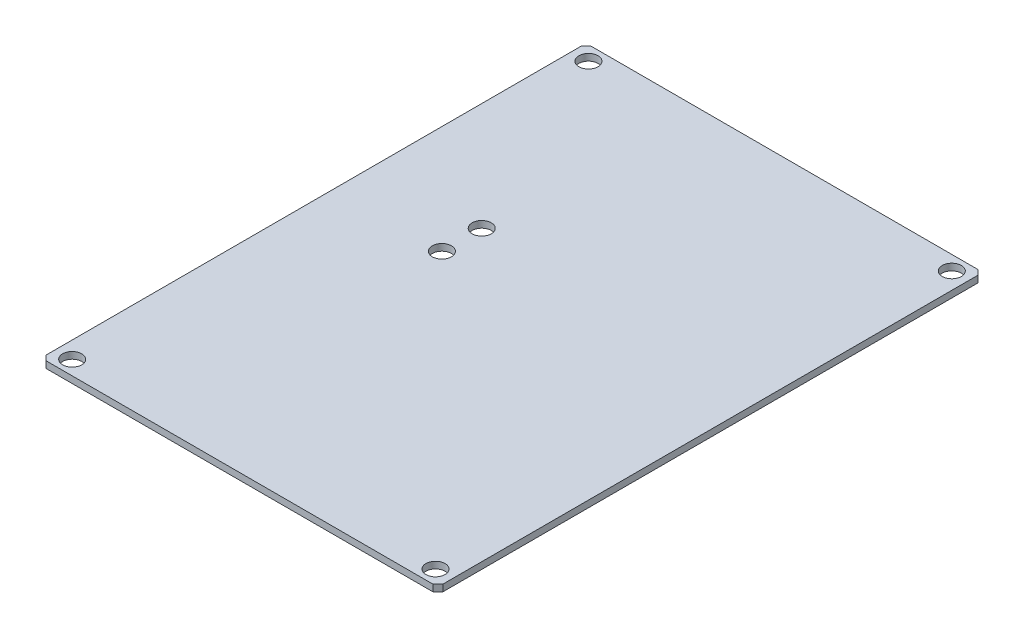
ISO-10303-21;
HEADER;
FILE_DESCRIPTION(('STEP AP214'),'2;1');
FILE_NAME('part.step','',(''),(''),'','','');
FILE_SCHEMA(('AUTOMOTIVE_DESIGN { 1 0 10303 214 1 1 1 1 }'));
ENDSEC;
DATA;
#1=APPLICATION_CONTEXT('core data for automotive mechanical design processes');
#2=APPLICATION_PROTOCOL_DEFINITION('international standard','automotive_design',2000,#1);
#3=PRODUCT_CONTEXT('',#1,'mechanical');
#4=PRODUCT('Part','Part','',(#3));
#5=PRODUCT_RELATED_PRODUCT_CATEGORY('part','',(#4));
#6=PRODUCT_DEFINITION_FORMATION('','',#4);
#7=PRODUCT_DEFINITION_CONTEXT('part definition',#1,'design');
#8=PRODUCT_DEFINITION('design','',#6,#7);
#9=PRODUCT_DEFINITION_SHAPE('','',#8);
#10=(LENGTH_UNIT() NAMED_UNIT(*) SI_UNIT(.MILLI.,.METRE.));
#11=(NAMED_UNIT(*) PLANE_ANGLE_UNIT() SI_UNIT($,.RADIAN.));
#12=(NAMED_UNIT(*) SI_UNIT($,.STERADIAN.) SOLID_ANGLE_UNIT());
#13=UNCERTAINTY_MEASURE_WITH_UNIT(LENGTH_MEASURE(1.E-05),#10,'distance_accuracy_value','');
#14=(GEOMETRIC_REPRESENTATION_CONTEXT(3) GLOBAL_UNCERTAINTY_ASSIGNED_CONTEXT((#13)) GLOBAL_UNIT_ASSIGNED_CONTEXT((#10,
#11,#12)) REPRESENTATION_CONTEXT('',''));
#15=CARTESIAN_POINT('',(0.,0.,0.));
#16=DIRECTION('',(0.,0.,1.));
#17=DIRECTION('',(1.,0.,0.));
#18=AXIS2_PLACEMENT_3D('',#15,#16,#17);
#19=CARTESIAN_POINT('',(20.75,0.7,0.));
#20=DIRECTION('',(1.,0.,0.));
#21=DIRECTION('',(0.,0.,-1.));
#22=AXIS2_PLACEMENT_3D('',#19,#20,#21);
#23=PLANE('',#22);
#24=DIRECTION('',(0.,0.,1.));
#25=VECTOR('',#24,1.);
#26=CARTESIAN_POINT('',(20.75,0.,0.));
#27=LINE('',#26,#25);
#28=CARTESIAN_POINT('',(20.75,0.,-27.9901394034831));
#29=VERTEX_POINT('',#28);
#30=CARTESIAN_POINT('',(20.75,0.,27.9901394034831));
#31=VERTEX_POINT('',#30);
#32=EDGE_CURVE('E131',#29,#31,#27,.T.);
#33=ORIENTED_EDGE('',*,*,#32,.F.);
#34=DIRECTION('',(0.,-1.,0.));
#35=VECTOR('',#34,1.);
#36=CARTESIAN_POINT('',(20.75,0.7,-27.9901394034831));
#37=LINE('',#36,#35);
#38=CARTESIAN_POINT('',(20.75,0.7,-27.9901394034831));
#39=VERTEX_POINT('',#38);
#40=EDGE_CURVE('E11',#39,#29,#37,.T.);
#41=ORIENTED_EDGE('',*,*,#40,.F.);
#42=DIRECTION('',(0.,0.,1.));
#43=VECTOR('',#42,1.);
#44=CARTESIAN_POINT('',(20.75,0.7,0.));
#45=LINE('',#44,#43);
#46=CARTESIAN_POINT('',(20.75,0.7,27.9901394034831));
#47=VERTEX_POINT('',#46);
#48=EDGE_CURVE('E152',#39,#47,#45,.T.);
#49=ORIENTED_EDGE('',*,*,#48,.T.);
#50=DIRECTION('',(0.,-1.,0.));
#51=VECTOR('',#50,1.);
#52=CARTESIAN_POINT('',(20.75,0.7,27.9901394034831));
#53=LINE('',#52,#51);
#54=EDGE_CURVE('E53',#47,#31,#53,.T.);
#55=ORIENTED_EDGE('',*,*,#54,.T.);
#56=EDGE_LOOP('',(#33,#41,#49,#55));
#57=FACE_BOUND('',#56,.T.);
#58=ADVANCED_FACE('F35',(#57),#23,.T.);
#59=CARTESIAN_POINT('',(24.3700697017416,0.7,-24.3700697017415));
#60=DIRECTION('',(-0.707106781186549,0.,0.707106781186546));
#61=DIRECTION('',(0.707106781186546,0.,0.707106781186549));
#62=AXIS2_PLACEMENT_3D('',#59,#60,#61);
#63=PLANE('',#62);
#64=DIRECTION('',(-0.707106781186546,0.,-0.707106781186549));
#65=VECTOR('',#64,1.);
#66=CARTESIAN_POINT('',(24.3700697017416,0.,-24.3700697017415));
#67=LINE('',#66,#65);
#68=CARTESIAN_POINT('',(20.2401394034831,0.,-28.5));
#69=VERTEX_POINT('',#68);
#70=EDGE_CURVE('E133',#29,#69,#67,.T.);
#71=ORIENTED_EDGE('',*,*,#70,.T.);
#72=DIRECTION('',(0.,-1.,0.));
#73=VECTOR('',#72,1.);
#74=CARTESIAN_POINT('',(20.2401394034831,0.7,-28.5));
#75=LINE('',#74,#73);
#76=CARTESIAN_POINT('',(20.2401394034831,0.7,-28.5));
#77=VERTEX_POINT('',#76);
#78=EDGE_CURVE('E44',#77,#69,#75,.T.);
#79=ORIENTED_EDGE('',*,*,#78,.F.);
#80=DIRECTION('',(-0.707106781186546,0.,-0.707106781186549));
#81=VECTOR('',#80,1.);
#82=CARTESIAN_POINT('',(24.3700697017416,0.7,-24.3700697017415));
#83=LINE('',#82,#81);
#84=EDGE_CURVE('E198',#39,#77,#83,.T.);
#85=ORIENTED_EDGE('',*,*,#84,.F.);
#86=ORIENTED_EDGE('',*,*,#40,.T.);
#87=EDGE_LOOP('',(#71,#79,#85,#86));
#88=FACE_BOUND('',#87,.T.);
#89=ADVANCED_FACE('F225',(#88),#63,.F.);
#90=CARTESIAN_POINT('',(0.,0.7,-28.5));
#91=DIRECTION('',(0.,0.,-1.));
#92=DIRECTION('',(-1.,0.,0.));
#93=AXIS2_PLACEMENT_3D('',#90,#91,#92);
#94=PLANE('',#93);
#95=DIRECTION('',(1.,0.,0.));
#96=VECTOR('',#95,1.);
#97=CARTESIAN_POINT('',(0.,0.,-28.5));
#98=LINE('',#97,#96);
#99=CARTESIAN_POINT('',(-20.2401394034831,0.,-28.5));
#100=VERTEX_POINT('',#99);
#101=EDGE_CURVE('E137',#100,#69,#98,.T.);
#102=ORIENTED_EDGE('',*,*,#101,.F.);
#103=DIRECTION('',(0.,-1.,0.));
#104=VECTOR('',#103,1.);
#105=CARTESIAN_POINT('',(-20.2401394034831,0.7,-28.5));
#106=LINE('',#105,#104);
#107=CARTESIAN_POINT('',(-20.2401394034831,0.7,-28.5));
#108=VERTEX_POINT('',#107);
#109=EDGE_CURVE('E158',#108,#100,#106,.T.);
#110=ORIENTED_EDGE('',*,*,#109,.F.);
#111=DIRECTION('',(1.,0.,0.));
#112=VECTOR('',#111,1.);
#113=CARTESIAN_POINT('',(0.,0.7,-28.5));
#114=LINE('',#113,#112);
#115=EDGE_CURVE('E200',#108,#77,#114,.T.);
#116=ORIENTED_EDGE('',*,*,#115,.T.);
#117=ORIENTED_EDGE('',*,*,#78,.T.);
#118=EDGE_LOOP('',(#102,#110,#116,#117));
#119=FACE_BOUND('',#118,.T.);
#120=ADVANCED_FACE('F229',(#119),#94,.T.);
#121=CARTESIAN_POINT('',(-24.3700697017416,0.7,-24.3700697017415));
#122=DIRECTION('',(-0.707106781186549,0.,-0.707106781186546));
#123=DIRECTION('',(-0.707106781186546,0.,0.707106781186549));
#124=AXIS2_PLACEMENT_3D('',#121,#122,#123);
#125=PLANE('',#124);
#126=DIRECTION('',(0.707106781186546,0.,-0.707106781186549));
#127=VECTOR('',#126,1.);
#128=CARTESIAN_POINT('',(-24.3700697017416,0.,-24.3700697017415));
#129=LINE('',#128,#127);
#130=CARTESIAN_POINT('',(-20.75,0.,-27.9901394034831));
#131=VERTEX_POINT('',#130);
#132=EDGE_CURVE('E140',#131,#100,#129,.T.);
#133=ORIENTED_EDGE('',*,*,#132,.F.);
#134=DIRECTION('',(0.,-1.,0.));
#135=VECTOR('',#134,1.);
#136=CARTESIAN_POINT('',(-20.75,0.7,-27.9901394034831));
#137=LINE('',#136,#135);
#138=CARTESIAN_POINT('',(-20.75,0.7,-27.9901394034831));
#139=VERTEX_POINT('',#138);
#140=EDGE_CURVE('E156',#139,#131,#137,.T.);
#141=ORIENTED_EDGE('',*,*,#140,.F.);
#142=DIRECTION('',(0.707106781186546,0.,-0.707106781186549));
#143=VECTOR('',#142,1.);
#144=CARTESIAN_POINT('',(-24.3700697017416,0.7,-24.3700697017415));
#145=LINE('',#144,#143);
#146=EDGE_CURVE('E203',#139,#108,#145,.T.);
#147=ORIENTED_EDGE('',*,*,#146,.T.);
#148=ORIENTED_EDGE('',*,*,#109,.T.);
#149=EDGE_LOOP('',(#133,#141,#147,#148));
#150=FACE_BOUND('',#149,.T.);
#151=ADVANCED_FACE('F234',(#150),#125,.T.);
#152=CARTESIAN_POINT('',(-20.75,0.7,0.));
#153=DIRECTION('',(-1.,0.,0.));
#154=DIRECTION('',(0.,0.,1.));
#155=AXIS2_PLACEMENT_3D('',#152,#153,#154);
#156=PLANE('',#155);
#157=DIRECTION('',(0.,0.,-1.));
#158=VECTOR('',#157,1.);
#159=CARTESIAN_POINT('',(-20.75,0.,0.));
#160=LINE('',#159,#158);
#161=CARTESIAN_POINT('',(-20.75,0.,27.9901394034831));
#162=VERTEX_POINT('',#161);
#163=EDGE_CURVE('E143',#162,#131,#160,.T.);
#164=ORIENTED_EDGE('',*,*,#163,.F.);
#165=DIRECTION('',(0.,-1.,0.));
#166=VECTOR('',#165,1.);
#167=CARTESIAN_POINT('',(-20.75,0.7,27.9901394034831));
#168=LINE('',#167,#166);
#169=CARTESIAN_POINT('',(-20.75,0.7,27.9901394034831));
#170=VERTEX_POINT('',#169);
#171=EDGE_CURVE('E123',#170,#162,#168,.T.);
#172=ORIENTED_EDGE('',*,*,#171,.F.);
#173=DIRECTION('',(0.,0.,-1.));
#174=VECTOR('',#173,1.);
#175=CARTESIAN_POINT('',(-20.75,0.7,0.));
#176=LINE('',#175,#174);
#177=EDGE_CURVE('E113',#170,#139,#176,.T.);
#178=ORIENTED_EDGE('',*,*,#177,.T.);
#179=ORIENTED_EDGE('',*,*,#140,.T.);
#180=EDGE_LOOP('',(#164,#172,#178,#179));
#181=FACE_BOUND('',#180,.T.);
#182=ADVANCED_FACE('F207',(#181),#156,.T.);
#183=CARTESIAN_POINT('',(-24.3700697017416,0.7,24.3700697017415));
#184=DIRECTION('',(0.707106781186549,0.,-0.707106781186546));
#185=DIRECTION('',(-0.707106781186546,0.,-0.707106781186549));
#186=AXIS2_PLACEMENT_3D('',#183,#184,#185);
#187=PLANE('',#186);
#188=DIRECTION('',(0.707106781186546,0.,0.707106781186549));
#189=VECTOR('',#188,1.);
#190=CARTESIAN_POINT('',(-24.3700697017416,0.,24.3700697017415));
#191=LINE('',#190,#189);
#192=CARTESIAN_POINT('',(-20.2401394034831,0.,28.5));
#193=VERTEX_POINT('',#192);
#194=EDGE_CURVE('E120',#162,#193,#191,.T.);
#195=ORIENTED_EDGE('',*,*,#194,.T.);
#196=DIRECTION('',(0.,-1.,0.));
#197=VECTOR('',#196,1.);
#198=CARTESIAN_POINT('',(-20.2401394034831,0.7,28.5));
#199=LINE('',#198,#197);
#200=CARTESIAN_POINT('',(-20.2401394034831,0.7,28.5));
#201=VERTEX_POINT('',#200);
#202=EDGE_CURVE('E117',#201,#193,#199,.T.);
#203=ORIENTED_EDGE('',*,*,#202,.F.);
#204=DIRECTION('',(0.707106781186546,0.,0.707106781186549));
#205=VECTOR('',#204,1.);
#206=CARTESIAN_POINT('',(-24.3700697017416,0.7,24.3700697017415));
#207=LINE('',#206,#205);
#208=EDGE_CURVE('E104',#170,#201,#207,.T.);
#209=ORIENTED_EDGE('',*,*,#208,.F.);
#210=ORIENTED_EDGE('',*,*,#171,.T.);
#211=EDGE_LOOP('',(#195,#203,#209,#210));
#212=FACE_BOUND('',#211,.T.);
#213=ADVANCED_FACE('F118',(#212),#187,.F.);
#214=CARTESIAN_POINT('',(0.,0.7,28.5));
#215=DIRECTION('',(0.,0.,-1.));
#216=DIRECTION('',(-1.,0.,0.));
#217=AXIS2_PLACEMENT_3D('',#214,#215,#216);
#218=PLANE('',#217);
#219=DIRECTION('',(1.,0.,0.));
#220=VECTOR('',#219,1.);
#221=CARTESIAN_POINT('',(0.,0.,28.5));
#222=LINE('',#221,#220);
#223=CARTESIAN_POINT('',(20.2401394034831,0.,28.5));
#224=VERTEX_POINT('',#223);
#225=EDGE_CURVE('E147',#193,#224,#222,.T.);
#226=ORIENTED_EDGE('',*,*,#225,.T.);
#227=DIRECTION('',(0.,-1.,0.));
#228=VECTOR('',#227,1.);
#229=CARTESIAN_POINT('',(20.2401394034831,0.7,28.5));
#230=LINE('',#229,#228);
#231=CARTESIAN_POINT('',(20.2401394034831,0.7,28.5));
#232=VERTEX_POINT('',#231);
#233=EDGE_CURVE('E79',#232,#224,#230,.T.);
#234=ORIENTED_EDGE('',*,*,#233,.F.);
#235=DIRECTION('',(1.,0.,0.));
#236=VECTOR('',#235,1.);
#237=CARTESIAN_POINT('',(0.,0.7,28.5));
#238=LINE('',#237,#236);
#239=EDGE_CURVE('E110',#201,#232,#238,.T.);
#240=ORIENTED_EDGE('',*,*,#239,.F.);
#241=ORIENTED_EDGE('',*,*,#202,.T.);
#242=EDGE_LOOP('',(#226,#234,#240,#241));
#243=FACE_BOUND('',#242,.T.);
#244=ADVANCED_FACE('F125',(#243),#218,.F.);
#245=CARTESIAN_POINT('',(24.3700697017416,0.7,24.3700697017415));
#246=DIRECTION('',(0.707106781186549,0.,0.707106781186546));
#247=DIRECTION('',(0.707106781186546,0.,-0.707106781186549));
#248=AXIS2_PLACEMENT_3D('',#245,#246,#247);
#249=PLANE('',#248);
#250=DIRECTION('',(-0.707106781186546,0.,0.707106781186549));
#251=VECTOR('',#250,1.);
#252=CARTESIAN_POINT('',(24.3700697017416,0.,24.3700697017415));
#253=LINE('',#252,#251);
#254=EDGE_CURVE('E149',#31,#224,#253,.T.);
#255=ORIENTED_EDGE('',*,*,#254,.F.);
#256=ORIENTED_EDGE('',*,*,#54,.F.);
#257=DIRECTION('',(-0.707106781186546,0.,0.707106781186549));
#258=VECTOR('',#257,1.);
#259=CARTESIAN_POINT('',(24.3700697017416,0.7,24.3700697017415));
#260=LINE('',#259,#258);
#261=EDGE_CURVE('E126',#47,#232,#260,.T.);
#262=ORIENTED_EDGE('',*,*,#261,.T.);
#263=ORIENTED_EDGE('',*,*,#233,.T.);
#264=EDGE_LOOP('',(#255,#256,#262,#263));
#265=FACE_BOUND('',#264,.T.);
#266=ADVANCED_FACE('F212',(#265),#249,.T.);
#267=CARTESIAN_POINT('',(0.,0.7,0.));
#268=DIRECTION('',(0.,1.,0.));
#269=DIRECTION('',(0.,0.,1.));
#270=AXIS2_PLACEMENT_3D('',#267,#268,#269);
#271=PLANE('',#270);
#272=CARTESIAN_POINT('',(-9.45,0.7,-6.28453018887489));
#273=DIRECTION('',(0.,1.,0.));
#274=DIRECTION('',(0.,0.,1.));
#275=AXIS2_PLACEMENT_3D('',#272,#273,#274);
#276=CIRCLE('',#275,1.);
#277=CARTESIAN_POINT('',(-9.45,0.7,-5.28453018887489));
#278=VERTEX_POINT('',#277);
#279=EDGE_CURVE('E174',#278,#278,#276,.T.);
#280=ORIENTED_EDGE('',*,*,#279,.F.);
#281=EDGE_LOOP('',(#280));
#282=FACE_BOUND('',#281,.T.);
#283=CARTESIAN_POINT('',(-9.45,0.7,-2.11546981112506));
#284=DIRECTION('',(0.,1.,0.));
#285=DIRECTION('',(0.,0.,1.));
#286=AXIS2_PLACEMENT_3D('',#283,#284,#285);
#287=CIRCLE('',#286,1.00000000000001);
#288=CARTESIAN_POINT('',(-9.45,0.7,-1.11546981112506));
#289=VERTEX_POINT('',#288);
#290=EDGE_CURVE('E180',#289,#289,#287,.T.);
#291=ORIENTED_EDGE('',*,*,#290,.F.);
#292=EDGE_LOOP('',(#291));
#293=FACE_BOUND('',#292,.T.);
#294=CARTESIAN_POINT('',(-19.,0.7,27.));
#295=DIRECTION('',(0.,1.,0.));
#296=DIRECTION('',(0.,0.,1.));
#297=AXIS2_PLACEMENT_3D('',#294,#295,#296);
#298=CIRCLE('',#297,1.);
#299=CARTESIAN_POINT('',(-19.,0.7,28.));
#300=VERTEX_POINT('',#299);
#301=EDGE_CURVE('E178',#300,#300,#298,.T.);
#302=ORIENTED_EDGE('',*,*,#301,.F.);
#303=EDGE_LOOP('',(#302));
#304=FACE_BOUND('',#303,.T.);
#305=CARTESIAN_POINT('',(19.,0.7,27.));
#306=DIRECTION('',(0.,1.,0.));
#307=DIRECTION('',(0.,0.,1.));
#308=AXIS2_PLACEMENT_3D('',#305,#306,#307);
#309=CIRCLE('',#308,1.);
#310=CARTESIAN_POINT('',(19.,0.7,28.));
#311=VERTEX_POINT('',#310);
#312=EDGE_CURVE('E190',#311,#311,#309,.T.);
#313=ORIENTED_EDGE('',*,*,#312,.F.);
#314=EDGE_LOOP('',(#313));
#315=FACE_BOUND('',#314,.T.);
#316=CARTESIAN_POINT('',(19.,0.7,-27.));
#317=DIRECTION('',(0.,1.,0.));
#318=DIRECTION('',(0.,0.,1.));
#319=AXIS2_PLACEMENT_3D('',#316,#317,#318);
#320=CIRCLE('',#319,1.);
#321=CARTESIAN_POINT('',(19.,0.7,-26.));
#322=VERTEX_POINT('',#321);
#323=EDGE_CURVE('E187',#322,#322,#320,.T.);
#324=ORIENTED_EDGE('',*,*,#323,.F.);
#325=EDGE_LOOP('',(#324));
#326=FACE_BOUND('',#325,.T.);
#327=CARTESIAN_POINT('',(-19.,0.7,-27.));
#328=DIRECTION('',(0.,1.,0.));
#329=DIRECTION('',(0.,0.,1.));
#330=AXIS2_PLACEMENT_3D('',#327,#328,#329);
#331=CIRCLE('',#330,0.999999999999998);
#332=CARTESIAN_POINT('',(-19.,0.7,-26.));
#333=VERTEX_POINT('',#332);
#334=EDGE_CURVE('E165',#333,#333,#331,.T.);
#335=ORIENTED_EDGE('',*,*,#334,.F.);
#336=EDGE_LOOP('',(#335));
#337=FACE_BOUND('',#336,.T.);
#338=ORIENTED_EDGE('',*,*,#48,.F.);
#339=ORIENTED_EDGE('',*,*,#84,.T.);
#340=ORIENTED_EDGE('',*,*,#115,.F.);
#341=ORIENTED_EDGE('',*,*,#146,.F.);
#342=ORIENTED_EDGE('',*,*,#177,.F.);
#343=ORIENTED_EDGE('',*,*,#208,.T.);
#344=ORIENTED_EDGE('',*,*,#239,.T.);
#345=ORIENTED_EDGE('',*,*,#261,.F.);
#346=EDGE_LOOP('',(#338,#339,#340,#341,#342,#343,#344,#345));
#347=FACE_BOUND('',#346,.T.);
#348=ADVANCED_FACE('F107',(#282,#293,#304,#315,#326,#337,#347),#271,.T.);
#349=CARTESIAN_POINT('',(0.,0.,0.));
#350=DIRECTION('',(0.,1.,0.));
#351=DIRECTION('',(0.,0.,1.));
#352=AXIS2_PLACEMENT_3D('',#349,#350,#351);
#353=PLANE('',#352);
#354=CARTESIAN_POINT('',(-9.45,0.,-6.28453018887489));
#355=DIRECTION('',(0.,1.,0.));
#356=DIRECTION('',(0.,0.,1.));
#357=AXIS2_PLACEMENT_3D('',#354,#355,#356);
#358=CIRCLE('',#357,1.);
#359=CARTESIAN_POINT('',(-9.45,0.,-5.28453018887489));
#360=VERTEX_POINT('',#359);
#361=EDGE_CURVE('E38',#360,#360,#358,.T.);
#362=ORIENTED_EDGE('',*,*,#361,.T.);
#363=EDGE_LOOP('',(#362));
#364=FACE_BOUND('',#363,.T.);
#365=CARTESIAN_POINT('',(-9.45,0.,-2.11546981112506));
#366=DIRECTION('',(0.,1.,0.));
#367=DIRECTION('',(0.,0.,1.));
#368=AXIS2_PLACEMENT_3D('',#365,#366,#367);
#369=CIRCLE('',#368,1.00000000000001);
#370=CARTESIAN_POINT('',(-9.45,0.,-1.11546981112506));
#371=VERTEX_POINT('',#370);
#372=EDGE_CURVE('E172',#371,#371,#369,.T.);
#373=ORIENTED_EDGE('',*,*,#372,.T.);
#374=EDGE_LOOP('',(#373));
#375=FACE_BOUND('',#374,.T.);
#376=CARTESIAN_POINT('',(-19.,0.,27.));
#377=DIRECTION('',(0.,1.,0.));
#378=DIRECTION('',(0.,0.,1.));
#379=AXIS2_PLACEMENT_3D('',#376,#377,#378);
#380=CIRCLE('',#379,1.);
#381=CARTESIAN_POINT('',(-19.,0.,28.));
#382=VERTEX_POINT('',#381);
#383=EDGE_CURVE('E134',#382,#382,#380,.T.);
#384=ORIENTED_EDGE('',*,*,#383,.T.);
#385=EDGE_LOOP('',(#384));
#386=FACE_BOUND('',#385,.T.);
#387=CARTESIAN_POINT('',(19.,0.,27.));
#388=DIRECTION('',(0.,1.,0.));
#389=DIRECTION('',(0.,0.,1.));
#390=AXIS2_PLACEMENT_3D('',#387,#388,#389);
#391=CIRCLE('',#390,1.);
#392=CARTESIAN_POINT('',(19.,0.,28.));
#393=VERTEX_POINT('',#392);
#394=EDGE_CURVE('E168',#393,#393,#391,.T.);
#395=ORIENTED_EDGE('',*,*,#394,.T.);
#396=EDGE_LOOP('',(#395));
#397=FACE_BOUND('',#396,.T.);
#398=CARTESIAN_POINT('',(19.,0.,-27.));
#399=DIRECTION('',(0.,1.,0.));
#400=DIRECTION('',(0.,0.,1.));
#401=AXIS2_PLACEMENT_3D('',#398,#399,#400);
#402=CIRCLE('',#401,1.);
#403=CARTESIAN_POINT('',(19.,0.,-26.));
#404=VERTEX_POINT('',#403);
#405=EDGE_CURVE('E164',#404,#404,#402,.T.);
#406=ORIENTED_EDGE('',*,*,#405,.T.);
#407=EDGE_LOOP('',(#406));
#408=FACE_BOUND('',#407,.T.);
#409=CARTESIAN_POINT('',(-19.,0.,-27.));
#410=DIRECTION('',(0.,1.,0.));
#411=DIRECTION('',(0.,0.,1.));
#412=AXIS2_PLACEMENT_3D('',#409,#410,#411);
#413=CIRCLE('',#412,0.999999999999998);
#414=CARTESIAN_POINT('',(-19.,0.,-26.));
#415=VERTEX_POINT('',#414);
#416=EDGE_CURVE('E161',#415,#415,#413,.T.);
#417=ORIENTED_EDGE('',*,*,#416,.T.);
#418=EDGE_LOOP('',(#417));
#419=FACE_BOUND('',#418,.T.);
#420=ORIENTED_EDGE('',*,*,#32,.T.);
#421=ORIENTED_EDGE('',*,*,#254,.T.);
#422=ORIENTED_EDGE('',*,*,#225,.F.);
#423=ORIENTED_EDGE('',*,*,#194,.F.);
#424=ORIENTED_EDGE('',*,*,#163,.T.);
#425=ORIENTED_EDGE('',*,*,#132,.T.);
#426=ORIENTED_EDGE('',*,*,#101,.T.);
#427=ORIENTED_EDGE('',*,*,#70,.F.);
#428=EDGE_LOOP('',(#420,#421,#422,#423,#424,#425,#426,#427));
#429=FACE_BOUND('',#428,.T.);
#430=ADVANCED_FACE('F210',(#364,#375,#386,#397,#408,#419,#429),#353,.F.);
#431=CARTESIAN_POINT('',(-19.,-4.3,-27.));
#432=DIRECTION('',(0.,1.,0.));
#433=DIRECTION('',(0.,0.,1.));
#434=AXIS2_PLACEMENT_3D('',#431,#432,#433);
#435=CYLINDRICAL_SURFACE('',#434,0.999999999999998);
#436=ORIENTED_EDGE('',*,*,#334,.T.);
#437=EDGE_LOOP('',(#436));
#438=FACE_BOUND('',#437,.T.);
#439=ORIENTED_EDGE('',*,*,#416,.F.);
#440=EDGE_LOOP('',(#439));
#441=FACE_BOUND('',#440,.T.);
#442=ADVANCED_FACE('F262',(#438,#441),#435,.F.);
#443=CARTESIAN_POINT('',(19.,-4.3,-27.));
#444=DIRECTION('',(0.,1.,0.));
#445=DIRECTION('',(0.,0.,1.));
#446=AXIS2_PLACEMENT_3D('',#443,#444,#445);
#447=CYLINDRICAL_SURFACE('',#446,1.);
#448=ORIENTED_EDGE('',*,*,#323,.T.);
#449=EDGE_LOOP('',(#448));
#450=FACE_BOUND('',#449,.T.);
#451=ORIENTED_EDGE('',*,*,#405,.F.);
#452=EDGE_LOOP('',(#451));
#453=FACE_BOUND('',#452,.T.);
#454=ADVANCED_FACE('F267',(#450,#453),#447,.F.);
#455=CARTESIAN_POINT('',(19.,-4.3,27.));
#456=DIRECTION('',(0.,1.,0.));
#457=DIRECTION('',(0.,0.,1.));
#458=AXIS2_PLACEMENT_3D('',#455,#456,#457);
#459=CYLINDRICAL_SURFACE('',#458,1.);
#460=ORIENTED_EDGE('',*,*,#312,.T.);
#461=EDGE_LOOP('',(#460));
#462=FACE_BOUND('',#461,.T.);
#463=ORIENTED_EDGE('',*,*,#394,.F.);
#464=EDGE_LOOP('',(#463));
#465=FACE_BOUND('',#464,.T.);
#466=ADVANCED_FACE('F279',(#462,#465),#459,.F.);
#467=CARTESIAN_POINT('',(-19.,-4.3,27.));
#468=DIRECTION('',(0.,1.,0.));
#469=DIRECTION('',(0.,0.,1.));
#470=AXIS2_PLACEMENT_3D('',#467,#468,#469);
#471=CYLINDRICAL_SURFACE('',#470,1.);
#472=ORIENTED_EDGE('',*,*,#301,.T.);
#473=EDGE_LOOP('',(#472));
#474=FACE_BOUND('',#473,.T.);
#475=ORIENTED_EDGE('',*,*,#383,.F.);
#476=EDGE_LOOP('',(#475));
#477=FACE_BOUND('',#476,.T.);
#478=ADVANCED_FACE('F289',(#474,#477),#471,.F.);
#479=CARTESIAN_POINT('',(-9.45,-5.3,-2.11546981112506));
#480=DIRECTION('',(0.,1.,0.));
#481=DIRECTION('',(0.,0.,1.));
#482=AXIS2_PLACEMENT_3D('',#479,#480,#481);
#483=CYLINDRICAL_SURFACE('',#482,1.00000000000001);
#484=ORIENTED_EDGE('',*,*,#290,.T.);
#485=EDGE_LOOP('',(#484));
#486=FACE_BOUND('',#485,.T.);
#487=ORIENTED_EDGE('',*,*,#372,.F.);
#488=EDGE_LOOP('',(#487));
#489=FACE_BOUND('',#488,.T.);
#490=ADVANCED_FACE('F298',(#486,#489),#483,.F.);
#491=CARTESIAN_POINT('',(-9.45,-5.3,-6.28453018887489));
#492=DIRECTION('',(0.,1.,0.));
#493=DIRECTION('',(0.,0.,1.));
#494=AXIS2_PLACEMENT_3D('',#491,#492,#493);
#495=CYLINDRICAL_SURFACE('',#494,1.);
#496=ORIENTED_EDGE('',*,*,#279,.T.);
#497=EDGE_LOOP('',(#496));
#498=FACE_BOUND('',#497,.T.);
#499=ORIENTED_EDGE('',*,*,#361,.F.);
#500=EDGE_LOOP('',(#499));
#501=FACE_BOUND('',#500,.T.);
#502=ADVANCED_FACE('F315',(#498,#501),#495,.F.);
#503=CLOSED_SHELL('',(#58,#89,#120,#151,#182,#213,#244,#266,#348,#430,#442,#454,#466,#478,#490,#502));
#504=MANIFOLD_SOLID_BREP('B2',#503);
#505=ADVANCED_BREP_SHAPE_REPRESENTATION('',(#18,#504),#14);
#506=SHAPE_DEFINITION_REPRESENTATION(#9,#505);
ENDSEC;
END-ISO-10303-21;
